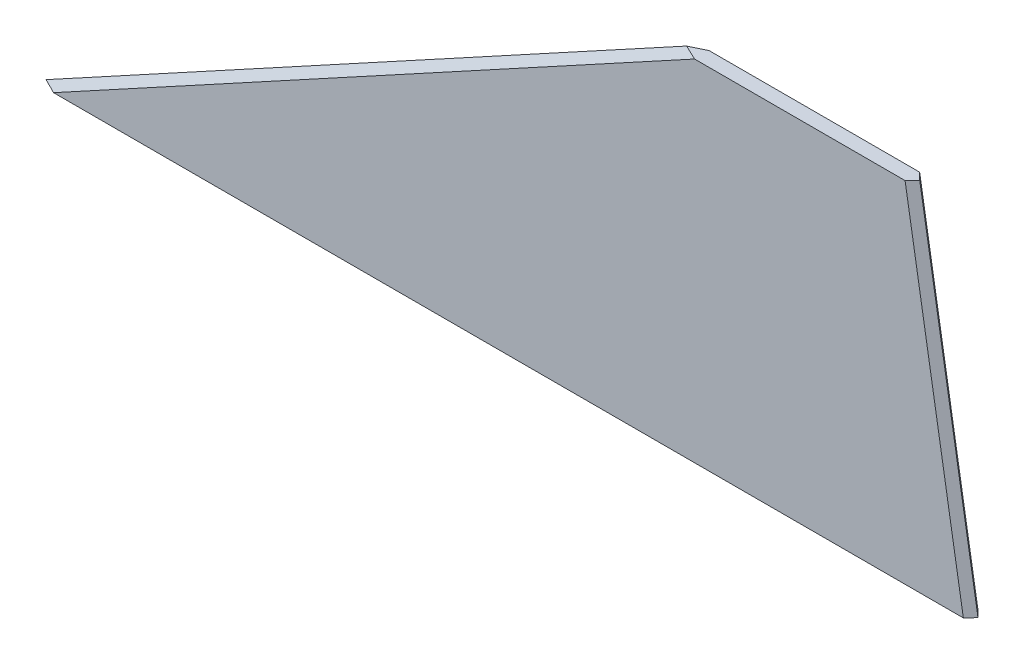
ISO-10303-21;
HEADER;
FILE_DESCRIPTION(('STEP AP214'),'2;1');
FILE_NAME('part.step','',(''),(''),'','','');
FILE_SCHEMA(('AUTOMOTIVE_DESIGN { 1 0 10303 214 1 1 1 1 }'));
ENDSEC;
DATA;
#1=APPLICATION_CONTEXT('core data for automotive mechanical design processes');
#2=APPLICATION_PROTOCOL_DEFINITION('international standard','automotive_design',2000,#1);
#3=PRODUCT_CONTEXT('',#1,'mechanical');
#4=PRODUCT('Part','Part','',(#3));
#5=PRODUCT_RELATED_PRODUCT_CATEGORY('part','',(#4));
#6=PRODUCT_DEFINITION_FORMATION('','',#4);
#7=PRODUCT_DEFINITION_CONTEXT('part definition',#1,'design');
#8=PRODUCT_DEFINITION('design','',#6,#7);
#9=PRODUCT_DEFINITION_SHAPE('','',#8);
#10=(LENGTH_UNIT() NAMED_UNIT(*) SI_UNIT(.MILLI.,.METRE.));
#11=(NAMED_UNIT(*) PLANE_ANGLE_UNIT() SI_UNIT($,.RADIAN.));
#12=(NAMED_UNIT(*) SI_UNIT($,.STERADIAN.) SOLID_ANGLE_UNIT());
#13=UNCERTAINTY_MEASURE_WITH_UNIT(LENGTH_MEASURE(1.E-05),#10,'distance_accuracy_value','');
#14=(GEOMETRIC_REPRESENTATION_CONTEXT(3) GLOBAL_UNCERTAINTY_ASSIGNED_CONTEXT((#13)) GLOBAL_UNIT_ASSIGNED_CONTEXT((#10,
#11,#12)) REPRESENTATION_CONTEXT('',''));
#15=CARTESIAN_POINT('',(0.,0.,0.));
#16=DIRECTION('',(0.,0.,1.));
#17=DIRECTION('',(1.,0.,0.));
#18=AXIS2_PLACEMENT_3D('',#15,#16,#17);
#19=CARTESIAN_POINT('',(0.,152.4,6.35));
#20=DIRECTION('',(0.,1.,0.));
#21=DIRECTION('',(0.,0.,1.));
#22=AXIS2_PLACEMENT_3D('',#19,#20,#21);
#23=PLANE('',#22);
#24=DIRECTION('',(1.,0.,0.));
#25=VECTOR('',#24,1.);
#26=CARTESIAN_POINT('',(0.,152.4,6.35));
#27=LINE('',#26,#25);
#28=CARTESIAN_POINT('',(286.030439328917,152.4,6.35));
#29=VERTEX_POINT('',#28);
#30=CARTESIAN_POINT('',(377.781204827717,152.4,6.35));
#31=VERTEX_POINT('',#30);
#32=EDGE_CURVE('E137',#29,#31,#27,.T.);
#33=ORIENTED_EDGE('',*,*,#32,.T.);
#34=DIRECTION('',(0.711933504667742,0.,-0.702246883176783));
#35=VECTOR('',#34,1.);
#36=CARTESIAN_POINT('',(186.303059915038,152.4,195.222878688517));
#37=LINE('',#36,#35);
#38=CARTESIAN_POINT('',(381.,152.4,3.17499999999998));
#39=VERTEX_POINT('',#38);
#40=EDGE_CURVE('E120',#31,#39,#37,.T.);
#41=ORIENTED_EDGE('',*,*,#40,.T.);
#42=DIRECTION('',(0.711933504667742,0.,0.702246883176783));
#43=VECTOR('',#42,1.);
#44=CARTESIAN_POINT('',(189.477762002769,152.4,-185.741371839202));
#45=LINE('',#44,#43);
#46=CARTESIAN_POINT('',(377.781204827717,152.4,0.));
#47=VERTEX_POINT('',#46);
#48=EDGE_CURVE('E123',#39,#47,#45,.F.);
#49=ORIENTED_EDGE('',*,*,#48,.T.);
#50=DIRECTION('',(1.,0.,0.));
#51=VECTOR('',#50,1.);
#52=CARTESIAN_POINT('',(0.,152.4,0.));
#53=LINE('',#52,#51);
#54=CARTESIAN_POINT('',(286.030439328917,152.4,0.));
#55=VERTEX_POINT('',#54);
#56=EDGE_CURVE('E115',#55,#47,#53,.T.);
#57=ORIENTED_EDGE('',*,*,#56,.F.);
#58=DIRECTION('',(-0.901926550552024,0.,0.431889450449217));
#59=VECTOR('',#58,1.);
#60=CARTESIAN_POINT('',(50.8792962909793,152.4,112.602625875689));
#61=LINE('',#60,#59);
#62=CARTESIAN_POINT('',(279.4,152.4,3.17499999999994));
#63=VERTEX_POINT('',#62);
#64=EDGE_CURVE('E119',#55,#63,#61,.T.);
#65=ORIENTED_EDGE('',*,*,#64,.T.);
#66=DIRECTION('',(-0.901926550552024,0.,-0.431889450449217));
#67=VECTOR('',#66,1.);
#68=CARTESIAN_POINT('',(53.3528280613524,152.4,-105.068169917139));
#69=LINE('',#68,#67);
#70=EDGE_CURVE('E147',#63,#29,#69,.F.);
#71=ORIENTED_EDGE('',*,*,#70,.T.);
#72=EDGE_LOOP('',(#33,#41,#49,#57,#65,#71));
#73=FACE_BOUND('',#72,.T.);
#74=ADVANCED_FACE('F49',(#73),#23,.T.);
#75=CARTESIAN_POINT('',(0.,0.,6.35));
#76=DIRECTION('',(0.,0.,1.));
#77=DIRECTION('',(1.,0.,0.));
#78=AXIS2_PLACEMENT_3D('',#75,#76,#77);
#79=PLANE('',#78);
#80=DIRECTION('',(1.,0.,0.));
#81=VECTOR('',#80,1.);
#82=CARTESIAN_POINT('',(0.,0.,6.35));
#83=LINE('',#82,#81);
#84=CARTESIAN_POINT('',(6.63043932891672,0.,6.35));
#85=VERTEX_POINT('',#84);
#86=CARTESIAN_POINT('',(403.181204827717,0.,6.35));
#87=VERTEX_POINT('',#86);
#88=EDGE_CURVE('E134',#85,#87,#83,.T.);
#89=ORIENTED_EDGE('',*,*,#88,.T.);
#90=DIRECTION('',(-0.164398987305357,0.986393923832144,0.));
#91=VECTOR('',#90,1.);
#92=CARTESIAN_POINT('',(377.868199291833,151.878033215305,6.35));
#93=LINE('',#92,#91);
#94=EDGE_CURVE('E144',#87,#31,#93,.T.);
#95=ORIENTED_EDGE('',*,*,#94,.T.);
#96=ORIENTED_EDGE('',*,*,#32,.F.);
#97=DIRECTION('',(-0.877895572914384,-0.478852130680573,0.));
#98=VECTOR('',#97,1.);
#99=CARTESIAN_POINT('',(1.52035551491084,-2.7873184440032,6.35));
#100=LINE('',#99,#98);
#101=EDGE_CURVE('E139',#29,#85,#100,.T.);
#102=ORIENTED_EDGE('',*,*,#101,.T.);
#103=EDGE_LOOP('',(#89,#95,#96,#102));
#104=FACE_BOUND('',#103,.T.);
#105=ADVANCED_FACE('F161',(#104),#79,.T.);
#106=CARTESIAN_POINT('',(0.,0.,0.));
#107=DIRECTION('',(0.,0.,1.));
#108=DIRECTION('',(1.,0.,0.));
#109=AXIS2_PLACEMENT_3D('',#106,#107,#108);
#110=PLANE('',#109);
#111=ORIENTED_EDGE('',*,*,#56,.T.);
#112=DIRECTION('',(0.164398987305357,-0.986393923832144,0.));
#113=VECTOR('',#112,1.);
#114=CARTESIAN_POINT('',(392.284415508049,65.3807359180081,0.));
#115=LINE('',#114,#113);
#116=CARTESIAN_POINT('',(403.181204827717,0.,0.));
#117=VERTEX_POINT('',#116);
#118=EDGE_CURVE('E58',#47,#117,#115,.T.);
#119=ORIENTED_EDGE('',*,*,#118,.T.);
#120=DIRECTION('',(1.,0.,0.));
#121=VECTOR('',#120,1.);
#122=CARTESIAN_POINT('',(0.,0.,0.));
#123=LINE('',#122,#121);
#124=CARTESIAN_POINT('',(6.63043932891688,0.,0.));
#125=VERTEX_POINT('',#124);
#126=EDGE_CURVE('E102',#125,#117,#123,.T.);
#127=ORIENTED_EDGE('',*,*,#126,.F.);
#128=DIRECTION('',(0.877895572914384,0.478852130680573,0.));
#129=VECTOR('',#128,1.);
#130=CARTESIAN_POINT('',(280.920355514911,149.612681555997,0.));
#131=LINE('',#130,#129);
#132=EDGE_CURVE('E112',#125,#55,#131,.T.);
#133=ORIENTED_EDGE('',*,*,#132,.T.);
#134=EDGE_LOOP('',(#111,#119,#127,#133));
#135=FACE_BOUND('',#134,.T.);
#136=ADVANCED_FACE('F111',(#135),#110,.F.);
#137=CARTESIAN_POINT('',(395.416216216216,65.9027027027027,3.17499999999998));
#138=DIRECTION('',(-0.697485832462915,-0.116247638743819,0.707106781186548));
#139=DIRECTION('',(-0.164398987305357,0.986393923832144,0.));
#140=AXIS2_PLACEMENT_3D('',#137,#138,#139);
#141=PLANE('',#140);
#142=CARTESIAN_POINT('',(414.85011402783,-50.7006841669814,3.175));
#143=DIRECTION('',(-0.697485832462915,-0.116247638743819,0.707106781186548));
#144=DIRECTION('',(0.716598572084479,-0.113147142960707,0.688247201611685));
#145=AXIS2_PLACEMENT_3D('',#142,#143,#144);
#146=ELLIPSE('',#145,72.8330205942943,50.8);
#147=CARTESIAN_POINT('',(406.383447361164,0.0993158330186011,3.17499999999998));
#148=VERTEX_POINT('',#147);
#149=EDGE_CURVE('E128',#117,#148,#146,.F.);
#150=ORIENTED_EDGE('',*,*,#149,.F.);
#151=ORIENTED_EDGE('',*,*,#118,.F.);
#152=ORIENTED_EDGE('',*,*,#48,.F.);
#153=DIRECTION('',(-0.164398987305357,0.986393923832144,0.));
#154=VECTOR('',#153,1.);
#155=CARTESIAN_POINT('',(395.416216216216,65.9027027027027,3.17499999999998));
#156=LINE('',#155,#154);
#157=EDGE_CURVE('E72',#148,#39,#156,.T.);
#158=ORIENTED_EDGE('',*,*,#157,.F.);
#159=EDGE_LOOP('',(#150,#151,#152,#158));
#160=FACE_BOUND('',#159,.T.);
#161=ADVANCED_FACE('F152',(#160),#141,.F.);
#162=CARTESIAN_POINT('',(392.284415508049,65.3807359180081,6.35));
#163=DIRECTION('',(0.697485832462915,0.116247638743819,0.707106781186548));
#164=DIRECTION('',(0.164398987305357,-0.986393923832144,0.));
#165=AXIS2_PLACEMENT_3D('',#162,#163,#164);
#166=PLANE('',#165);
#167=CARTESIAN_POINT('',(414.85011402783,-50.7006841669814,3.175));
#168=DIRECTION('',(0.697485832462915,0.116247638743819,0.707106781186548));
#169=DIRECTION('',(0.716598572084479,-0.113147142960707,-0.688247201611685));
#170=AXIS2_PLACEMENT_3D('',#167,#168,#169);
#171=ELLIPSE('',#170,72.8330205942943,50.8);
#172=EDGE_CURVE('E129',#148,#87,#171,.T.);
#173=ORIENTED_EDGE('',*,*,#172,.F.);
#174=ORIENTED_EDGE('',*,*,#157,.T.);
#175=ORIENTED_EDGE('',*,*,#40,.F.);
#176=ORIENTED_EDGE('',*,*,#94,.F.);
#177=EDGE_LOOP('',(#173,#174,#175,#176));
#178=FACE_BOUND('',#177,.T.);
#179=ADVANCED_FACE('F154',(#178),#166,.T.);
#180=CARTESIAN_POINT('',(0.,0.,3.17499999999996));
#181=DIRECTION('',(0.33859958878986,-0.62076591278141,-0.707106781186548));
#182=DIRECTION('',(0.877895572914384,0.478852130680573,0.));
#183=AXIS2_PLACEMENT_3D('',#180,#181,#182);
#184=PLANE('',#183);
#185=CARTESIAN_POINT('',(-92.9512543061325,-50.7006841669814,3.175));
#186=DIRECTION('',(0.33859958878986,-0.62076591278141,-0.707106781186548));
#187=DIRECTION('',(0.940930559856219,0.223386391908311,0.254456678903991));
#188=AXIS2_PLACEMENT_3D('',#185,#186,#187);
#189=ELLIPSE('',#188,150.029715575134,50.8);
#190=CARTESIAN_POINT('',(0.182079027200829,0.0993158330186338,3.17499999999994));
#191=VERTEX_POINT('',#190);
#192=EDGE_CURVE('E64',#85,#191,#189,.F.);
#193=ORIENTED_EDGE('',*,*,#192,.F.);
#194=ORIENTED_EDGE('',*,*,#101,.F.);
#195=ORIENTED_EDGE('',*,*,#70,.F.);
#196=DIRECTION('',(0.877895572914384,0.478852130680573,0.));
#197=VECTOR('',#196,1.);
#198=CARTESIAN_POINT('',(0.,0.,3.17499999999994));
#199=LINE('',#198,#197);
#200=EDGE_CURVE('E127',#191,#63,#199,.T.);
#201=ORIENTED_EDGE('',*,*,#200,.F.);
#202=EDGE_LOOP('',(#193,#194,#195,#201));
#203=FACE_BOUND('',#202,.T.);
#204=ADVANCED_FACE('F52',(#203),#184,.F.);
#205=CARTESIAN_POINT('',(1.52035551491084,-2.7873184440032,0.));
#206=DIRECTION('',(-0.33859958878986,0.62076591278141,-0.707106781186548));
#207=DIRECTION('',(-0.877895572914384,-0.478852130680573,0.));
#208=AXIS2_PLACEMENT_3D('',#205,#206,#207);
#209=PLANE('',#208);
#210=CARTESIAN_POINT('',(-92.9512543061325,-50.7006841669814,3.175));
#211=DIRECTION('',(-0.33859958878986,0.62076591278141,-0.707106781186548));
#212=DIRECTION('',(0.940930559856219,0.223386391908311,-0.254456678903991));
#213=AXIS2_PLACEMENT_3D('',#210,#211,#212);
#214=ELLIPSE('',#213,150.029715575134,50.8);
#215=EDGE_CURVE('E11',#191,#125,#214,.T.);
#216=ORIENTED_EDGE('',*,*,#215,.F.);
#217=ORIENTED_EDGE('',*,*,#200,.T.);
#218=ORIENTED_EDGE('',*,*,#64,.F.);
#219=ORIENTED_EDGE('',*,*,#132,.F.);
#220=EDGE_LOOP('',(#216,#217,#218,#219));
#221=FACE_BOUND('',#220,.T.);
#222=ADVANCED_FACE('F117',(#221),#209,.T.);
#223=CARTESIAN_POINT('',(-27.432,-50.7006841669814,3.175));
#224=DIRECTION('',(1.,0.,0.));
#225=DIRECTION('',(0.,0.,-1.));
#226=AXIS2_PLACEMENT_3D('',#223,#224,#225);
#227=CYLINDRICAL_SURFACE('',#226,50.8);
#228=ORIENTED_EDGE('',*,*,#149,.T.);
#229=ORIENTED_EDGE('',*,*,#172,.T.);
#230=ORIENTED_EDGE('',*,*,#88,.F.);
#231=ORIENTED_EDGE('',*,*,#192,.T.);
#232=ORIENTED_EDGE('',*,*,#215,.T.);
#233=ORIENTED_EDGE('',*,*,#126,.T.);
#234=EDGE_LOOP('',(#228,#229,#230,#231,#232,#233));
#235=FACE_BOUND('',#234,.T.);
#236=ADVANCED_FACE('F101',(#235),#227,.F.);
#237=CLOSED_SHELL('',(#74,#105,#136,#161,#179,#204,#222,#236));
#238=MANIFOLD_SOLID_BREP('B2',#237);
#239=ADVANCED_BREP_SHAPE_REPRESENTATION('',(#18,#238),#14);
#240=SHAPE_DEFINITION_REPRESENTATION(#9,#239);
ENDSEC;
END-ISO-10303-21;
